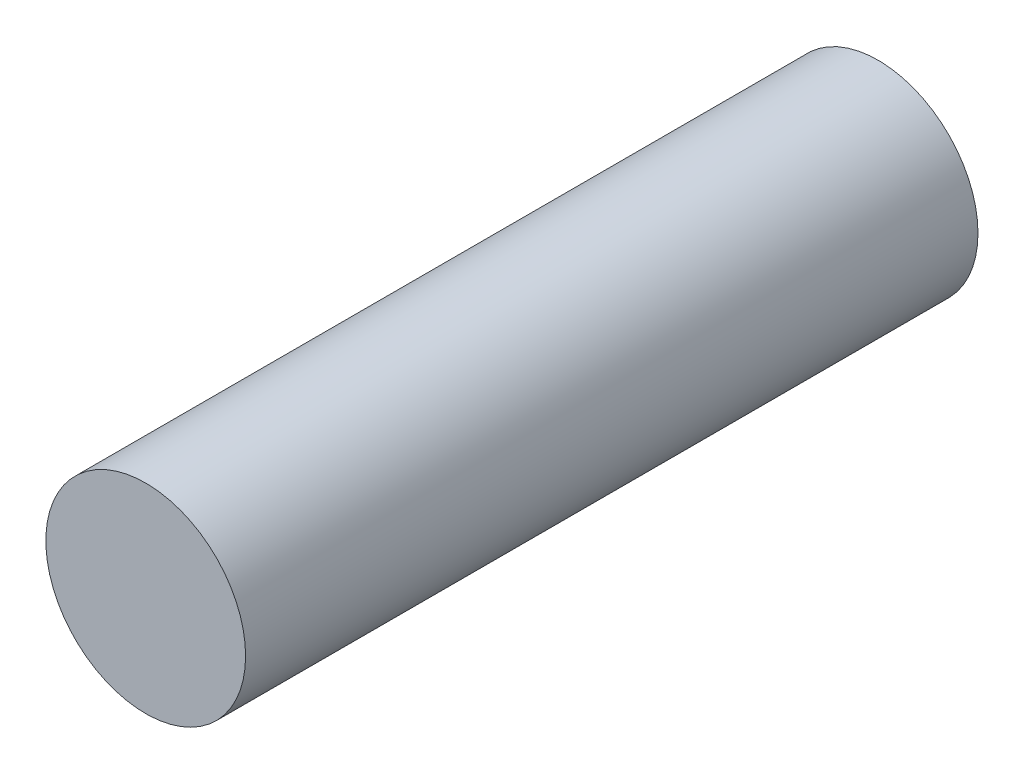
ISO-10303-21;
HEADER;
FILE_DESCRIPTION(('STEP AP214'),'2;1');
FILE_NAME('part.step','',(''),(''),'','','');
FILE_SCHEMA(('AUTOMOTIVE_DESIGN { 1 0 10303 214 1 1 1 1 }'));
ENDSEC;
DATA;
#1=APPLICATION_CONTEXT('core data for automotive mechanical design processes');
#2=APPLICATION_PROTOCOL_DEFINITION('international standard','automotive_design',2000,#1);
#3=PRODUCT_CONTEXT('',#1,'mechanical');
#4=PRODUCT('Part','Part','',(#3));
#5=PRODUCT_RELATED_PRODUCT_CATEGORY('part','',(#4));
#6=PRODUCT_DEFINITION_FORMATION('','',#4);
#7=PRODUCT_DEFINITION_CONTEXT('part definition',#1,'design');
#8=PRODUCT_DEFINITION('design','',#6,#7);
#9=PRODUCT_DEFINITION_SHAPE('','',#8);
#10=(LENGTH_UNIT() NAMED_UNIT(*) SI_UNIT(.MILLI.,.METRE.));
#11=(NAMED_UNIT(*) PLANE_ANGLE_UNIT() SI_UNIT($,.RADIAN.));
#12=(NAMED_UNIT(*) SI_UNIT($,.STERADIAN.) SOLID_ANGLE_UNIT());
#13=UNCERTAINTY_MEASURE_WITH_UNIT(LENGTH_MEASURE(1.E-05),#10,'distance_accuracy_value','');
#14=(GEOMETRIC_REPRESENTATION_CONTEXT(3) GLOBAL_UNCERTAINTY_ASSIGNED_CONTEXT((#13)) GLOBAL_UNIT_ASSIGNED_CONTEXT((#10,
#11,#12)) REPRESENTATION_CONTEXT('',''));
#15=CARTESIAN_POINT('',(0.,0.,0.));
#16=DIRECTION('',(0.,0.,1.));
#17=DIRECTION('',(1.,0.,0.));
#18=AXIS2_PLACEMENT_3D('',#15,#16,#17);
#19=CARTESIAN_POINT('',(0.,0.,69.85));
#20=DIRECTION('',(0.,0.,-1.));
#21=DIRECTION('',(-1.,0.,0.));
#22=AXIS2_PLACEMENT_3D('',#19,#20,#21);
#23=CYLINDRICAL_SURFACE('',#22,9.525);
#24=CARTESIAN_POINT('',(0.,0.,69.85));
#25=DIRECTION('',(0.,0.,1.));
#26=DIRECTION('',(1.,0.,0.));
#27=AXIS2_PLACEMENT_3D('',#24,#25,#26);
#28=CIRCLE('',#27,9.525);
#29=CARTESIAN_POINT('',(9.525,0.,69.85));
#30=VERTEX_POINT('',#29);
#31=EDGE_CURVE('E10',#30,#30,#28,.T.);
#32=ORIENTED_EDGE('',*,*,#31,.F.);
#33=EDGE_LOOP('',(#32));
#34=FACE_BOUND('',#33,.T.);
#35=CARTESIAN_POINT('',(0.,0.,0.));
#36=DIRECTION('',(0.,0.,1.));
#37=DIRECTION('',(1.,0.,0.));
#38=AXIS2_PLACEMENT_3D('',#35,#36,#37);
#39=CIRCLE('',#38,9.525);
#40=CARTESIAN_POINT('',(9.525,0.,0.));
#41=VERTEX_POINT('',#40);
#42=EDGE_CURVE('E33',#41,#41,#39,.T.);
#43=ORIENTED_EDGE('',*,*,#42,.T.);
#44=EDGE_LOOP('',(#43));
#45=FACE_BOUND('',#44,.T.);
#46=ADVANCED_FACE('F30',(#34,#45),#23,.T.);
#47=CARTESIAN_POINT('',(0.,0.,69.85));
#48=DIRECTION('',(0.,0.,1.));
#49=DIRECTION('',(1.,0.,0.));
#50=AXIS2_PLACEMENT_3D('',#47,#48,#49);
#51=PLANE('',#50);
#52=ORIENTED_EDGE('',*,*,#31,.T.);
#53=EDGE_LOOP('',(#52));
#54=FACE_BOUND('',#53,.T.);
#55=ADVANCED_FACE('F45',(#54),#51,.T.);
#56=CARTESIAN_POINT('',(0.,0.,0.));
#57=DIRECTION('',(0.,0.,1.));
#58=DIRECTION('',(1.,0.,0.));
#59=AXIS2_PLACEMENT_3D('',#56,#57,#58);
#60=PLANE('',#59);
#61=ORIENTED_EDGE('',*,*,#42,.F.);
#62=EDGE_LOOP('',(#61));
#63=FACE_BOUND('',#62,.T.);
#64=ADVANCED_FACE('F43',(#63),#60,.F.);
#65=CLOSED_SHELL('',(#46,#55,#64));
#66=MANIFOLD_SOLID_BREP('B2',#65);
#67=ADVANCED_BREP_SHAPE_REPRESENTATION('',(#18,#66),#14);
#68=SHAPE_DEFINITION_REPRESENTATION(#9,#67);
ENDSEC;
END-ISO-10303-21;
